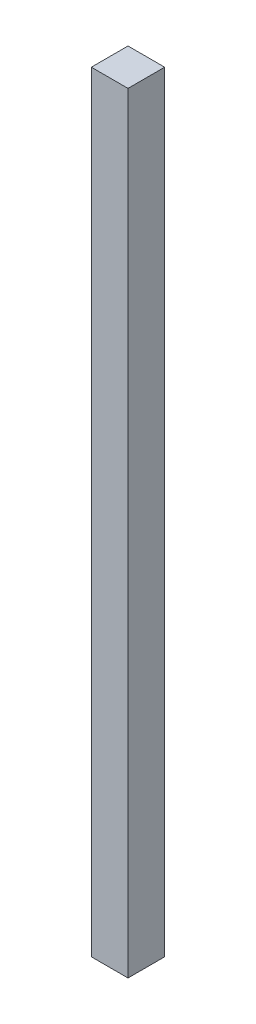
ISO-10303-21;
HEADER;
FILE_DESCRIPTION(('STEP AP214'),'2;1');
FILE_NAME('part.step','',(''),(''),'','','');
FILE_SCHEMA(('AUTOMOTIVE_DESIGN { 1 0 10303 214 1 1 1 1 }'));
ENDSEC;
DATA;
#1=APPLICATION_CONTEXT('core data for automotive mechanical design processes');
#2=APPLICATION_PROTOCOL_DEFINITION('international standard','automotive_design',2000,#1);
#3=PRODUCT_CONTEXT('',#1,'mechanical');
#4=PRODUCT('Part','Part','',(#3));
#5=PRODUCT_RELATED_PRODUCT_CATEGORY('part','',(#4));
#6=PRODUCT_DEFINITION_FORMATION('','',#4);
#7=PRODUCT_DEFINITION_CONTEXT('part definition',#1,'design');
#8=PRODUCT_DEFINITION('design','',#6,#7);
#9=PRODUCT_DEFINITION_SHAPE('','',#8);
#10=(LENGTH_UNIT() NAMED_UNIT(*) SI_UNIT(.MILLI.,.METRE.));
#11=(NAMED_UNIT(*) PLANE_ANGLE_UNIT() SI_UNIT($,.RADIAN.));
#12=(NAMED_UNIT(*) SI_UNIT($,.STERADIAN.) SOLID_ANGLE_UNIT());
#13=UNCERTAINTY_MEASURE_WITH_UNIT(LENGTH_MEASURE(1.E-05),#10,'distance_accuracy_value','');
#14=(GEOMETRIC_REPRESENTATION_CONTEXT(3) GLOBAL_UNCERTAINTY_ASSIGNED_CONTEXT((#13)) GLOBAL_UNIT_ASSIGNED_CONTEXT((#10,
#11,#12)) REPRESENTATION_CONTEXT('',''));
#15=CARTESIAN_POINT('',(0.,0.,0.));
#16=DIRECTION('',(0.,0.,1.));
#17=DIRECTION('',(1.,0.,0.));
#18=AXIS2_PLACEMENT_3D('',#15,#16,#17);
#19=CARTESIAN_POINT('',(-7.5,315.,-7.5));
#20=DIRECTION('',(1.,0.,0.));
#21=DIRECTION('',(0.,0.,-1.));
#22=AXIS2_PLACEMENT_3D('',#19,#20,#21);
#23=PLANE('',#22);
#24=DIRECTION('',(0.,0.,1.));
#25=VECTOR('',#24,1.);
#26=CARTESIAN_POINT('',(-7.5,0.,-7.5));
#27=LINE('',#26,#25);
#28=CARTESIAN_POINT('',(-7.5,0.,-7.5));
#29=VERTEX_POINT('',#28);
#30=CARTESIAN_POINT('',(-7.5,0.,7.5));
#31=VERTEX_POINT('',#30);
#32=EDGE_CURVE('E95',#29,#31,#27,.T.);
#33=ORIENTED_EDGE('',*,*,#32,.T.);
#34=DIRECTION('',(0.,-1.,0.));
#35=VECTOR('',#34,1.);
#36=CARTESIAN_POINT('',(-7.5,315.,7.5));
#37=LINE('',#36,#35);
#38=CARTESIAN_POINT('',(-7.5,315.,7.5));
#39=VERTEX_POINT('',#38);
#40=EDGE_CURVE('E11',#39,#31,#37,.T.);
#41=ORIENTED_EDGE('',*,*,#40,.F.);
#42=DIRECTION('',(0.,0.,1.));
#43=VECTOR('',#42,1.);
#44=CARTESIAN_POINT('',(-7.5,315.,-7.5));
#45=LINE('',#44,#43);
#46=CARTESIAN_POINT('',(-7.5,315.,-7.5));
#47=VERTEX_POINT('',#46);
#48=EDGE_CURVE('E83',#47,#39,#45,.T.);
#49=ORIENTED_EDGE('',*,*,#48,.F.);
#50=DIRECTION('',(0.,-1.,0.));
#51=VECTOR('',#50,1.);
#52=CARTESIAN_POINT('',(-7.5,315.,-7.5));
#53=LINE('',#52,#51);
#54=EDGE_CURVE('E91',#47,#29,#53,.T.);
#55=ORIENTED_EDGE('',*,*,#54,.T.);
#56=EDGE_LOOP('',(#33,#41,#49,#55));
#57=FACE_BOUND('',#56,.T.);
#58=ADVANCED_FACE('F32',(#57),#23,.F.);
#59=CARTESIAN_POINT('',(7.5,315.,7.5));
#60=DIRECTION('',(0.,0.,-1.));
#61=DIRECTION('',(-1.,0.,0.));
#62=AXIS2_PLACEMENT_3D('',#59,#60,#61);
#63=PLANE('',#62);
#64=DIRECTION('',(1.,0.,0.));
#65=VECTOR('',#64,1.);
#66=CARTESIAN_POINT('',(7.5,0.,7.5));
#67=LINE('',#66,#65);
#68=CARTESIAN_POINT('',(7.5,0.,7.5));
#69=VERTEX_POINT('',#68);
#70=EDGE_CURVE('E87',#31,#69,#67,.T.);
#71=ORIENTED_EDGE('',*,*,#70,.T.);
#72=DIRECTION('',(0.,-1.,0.));
#73=VECTOR('',#72,1.);
#74=CARTESIAN_POINT('',(7.5,315.,7.5));
#75=LINE('',#74,#73);
#76=CARTESIAN_POINT('',(7.5,315.,7.5));
#77=VERTEX_POINT('',#76);
#78=EDGE_CURVE('E40',#77,#69,#75,.T.);
#79=ORIENTED_EDGE('',*,*,#78,.F.);
#80=DIRECTION('',(1.,0.,0.));
#81=VECTOR('',#80,1.);
#82=CARTESIAN_POINT('',(7.5,315.,7.5));
#83=LINE('',#82,#81);
#84=EDGE_CURVE('E78',#39,#77,#83,.T.);
#85=ORIENTED_EDGE('',*,*,#84,.F.);
#86=ORIENTED_EDGE('',*,*,#40,.T.);
#87=EDGE_LOOP('',(#71,#79,#85,#86));
#88=FACE_BOUND('',#87,.T.);
#89=ADVANCED_FACE('F86',(#88),#63,.F.);
#90=CARTESIAN_POINT('',(7.5,315.,-7.5));
#91=DIRECTION('',(-1.,0.,0.));
#92=DIRECTION('',(0.,0.,1.));
#93=AXIS2_PLACEMENT_3D('',#90,#91,#92);
#94=PLANE('',#93);
#95=DIRECTION('',(0.,0.,-1.));
#96=VECTOR('',#95,1.);
#97=CARTESIAN_POINT('',(7.5,0.,-7.5));
#98=LINE('',#97,#96);
#99=CARTESIAN_POINT('',(7.5,0.,-7.5));
#100=VERTEX_POINT('',#99);
#101=EDGE_CURVE('E65',#69,#100,#98,.T.);
#102=ORIENTED_EDGE('',*,*,#101,.T.);
#103=DIRECTION('',(0.,-1.,0.));
#104=VECTOR('',#103,1.);
#105=CARTESIAN_POINT('',(7.5,315.,-7.5));
#106=LINE('',#105,#104);
#107=CARTESIAN_POINT('',(7.5,315.,-7.5));
#108=VERTEX_POINT('',#107);
#109=EDGE_CURVE('E88',#108,#100,#106,.T.);
#110=ORIENTED_EDGE('',*,*,#109,.F.);
#111=DIRECTION('',(0.,0.,-1.));
#112=VECTOR('',#111,1.);
#113=CARTESIAN_POINT('',(7.5,315.,-7.5));
#114=LINE('',#113,#112);
#115=EDGE_CURVE('E81',#77,#108,#114,.T.);
#116=ORIENTED_EDGE('',*,*,#115,.F.);
#117=ORIENTED_EDGE('',*,*,#78,.T.);
#118=EDGE_LOOP('',(#102,#110,#116,#117));
#119=FACE_BOUND('',#118,.T.);
#120=ADVANCED_FACE('F89',(#119),#94,.F.);
#121=CARTESIAN_POINT('',(7.5,315.,-7.5));
#122=DIRECTION('',(0.,0.,1.));
#123=DIRECTION('',(1.,0.,0.));
#124=AXIS2_PLACEMENT_3D('',#121,#122,#123);
#125=PLANE('',#124);
#126=DIRECTION('',(-1.,0.,0.));
#127=VECTOR('',#126,1.);
#128=CARTESIAN_POINT('',(7.5,0.,-7.5));
#129=LINE('',#128,#127);
#130=EDGE_CURVE('E71',#100,#29,#129,.T.);
#131=ORIENTED_EDGE('',*,*,#130,.T.);
#132=ORIENTED_EDGE('',*,*,#54,.F.);
#133=DIRECTION('',(-1.,0.,0.));
#134=VECTOR('',#133,1.);
#135=CARTESIAN_POINT('',(7.5,315.,-7.5));
#136=LINE('',#135,#134);
#137=EDGE_CURVE('E48',#108,#47,#136,.T.);
#138=ORIENTED_EDGE('',*,*,#137,.F.);
#139=ORIENTED_EDGE('',*,*,#109,.T.);
#140=EDGE_LOOP('',(#131,#132,#138,#139));
#141=FACE_BOUND('',#140,.T.);
#142=ADVANCED_FACE('F102',(#141),#125,.F.);
#143=CARTESIAN_POINT('',(0.,315.,0.));
#144=DIRECTION('',(0.,-1.,0.));
#145=DIRECTION('',(0.,0.,-1.));
#146=AXIS2_PLACEMENT_3D('',#143,#144,#145);
#147=PLANE('',#146);
#148=ORIENTED_EDGE('',*,*,#48,.T.);
#149=ORIENTED_EDGE('',*,*,#84,.T.);
#150=ORIENTED_EDGE('',*,*,#115,.T.);
#151=ORIENTED_EDGE('',*,*,#137,.T.);
#152=EDGE_LOOP('',(#148,#149,#150,#151));
#153=FACE_BOUND('',#152,.T.);
#154=ADVANCED_FACE('F79',(#153),#147,.F.);
#155=CARTESIAN_POINT('',(0.,0.,0.));
#156=DIRECTION('',(0.,-1.,0.));
#157=DIRECTION('',(0.,0.,-1.));
#158=AXIS2_PLACEMENT_3D('',#155,#156,#157);
#159=PLANE('',#158);
#160=ORIENTED_EDGE('',*,*,#32,.F.);
#161=ORIENTED_EDGE('',*,*,#130,.F.);
#162=ORIENTED_EDGE('',*,*,#101,.F.);
#163=ORIENTED_EDGE('',*,*,#70,.F.);
#164=EDGE_LOOP('',(#160,#161,#162,#163));
#165=FACE_BOUND('',#164,.T.);
#166=ADVANCED_FACE('F105',(#165),#159,.T.);
#167=CLOSED_SHELL('',(#58,#89,#120,#142,#154,#166));
#168=MANIFOLD_SOLID_BREP('B2',#167);
#169=ADVANCED_BREP_SHAPE_REPRESENTATION('',(#18,#168),#14);
#170=SHAPE_DEFINITION_REPRESENTATION(#9,#169);
ENDSEC;
END-ISO-10303-21;
